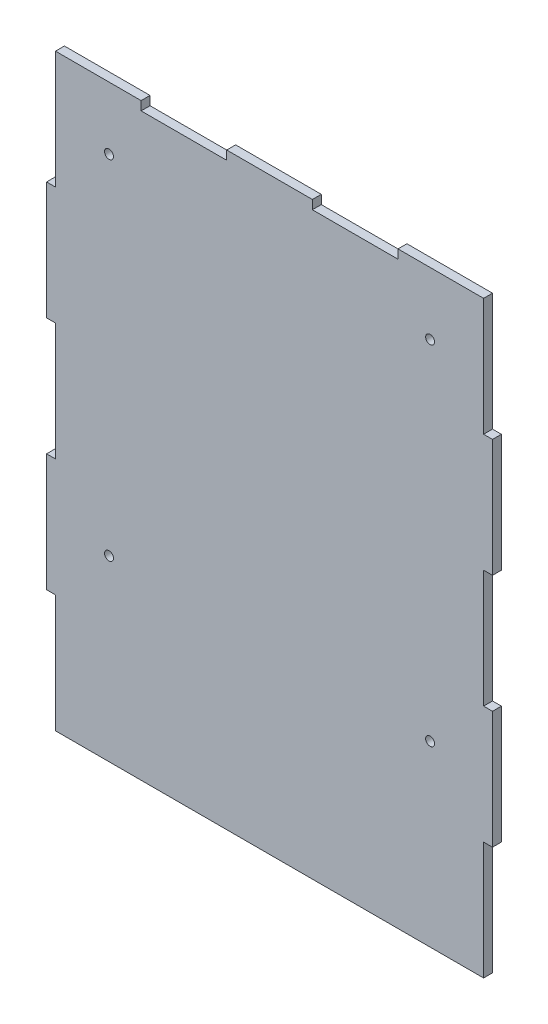
ISO-10303-21;
HEADER;
FILE_DESCRIPTION(('STEP AP214'),'2;1');
FILE_NAME('part.step','',(''),(''),'','','');
FILE_SCHEMA(('AUTOMOTIVE_DESIGN { 1 0 10303 214 1 1 1 1 }'));
ENDSEC;
DATA;
#1=APPLICATION_CONTEXT('core data for automotive mechanical design processes');
#2=APPLICATION_PROTOCOL_DEFINITION('international standard','automotive_design',2000,#1);
#3=PRODUCT_CONTEXT('',#1,'mechanical');
#4=PRODUCT('Part','Part','',(#3));
#5=PRODUCT_RELATED_PRODUCT_CATEGORY('part','',(#4));
#6=PRODUCT_DEFINITION_FORMATION('','',#4);
#7=PRODUCT_DEFINITION_CONTEXT('part definition',#1,'design');
#8=PRODUCT_DEFINITION('design','',#6,#7);
#9=PRODUCT_DEFINITION_SHAPE('','',#8);
#10=(LENGTH_UNIT() NAMED_UNIT(*) SI_UNIT(.MILLI.,.METRE.));
#11=(NAMED_UNIT(*) PLANE_ANGLE_UNIT() SI_UNIT($,.RADIAN.));
#12=(NAMED_UNIT(*) SI_UNIT($,.STERADIAN.) SOLID_ANGLE_UNIT());
#13=UNCERTAINTY_MEASURE_WITH_UNIT(LENGTH_MEASURE(1.E-05),#10,'distance_accuracy_value','');
#14=(GEOMETRIC_REPRESENTATION_CONTEXT(3) GLOBAL_UNCERTAINTY_ASSIGNED_CONTEXT((#13)) GLOBAL_UNIT_ASSIGNED_CONTEXT((#10,
#11,#12)) REPRESENTATION_CONTEXT('',''));
#15=CARTESIAN_POINT('',(0.,0.,0.));
#16=DIRECTION('',(0.,0.,1.));
#17=DIRECTION('',(1.,0.,0.));
#18=AXIS2_PLACEMENT_3D('',#15,#16,#17);
#19=CARTESIAN_POINT('',(250.,198.,5.));
#20=DIRECTION('',(-1.,0.,0.));
#21=DIRECTION('',(0.,0.,1.));
#22=AXIS2_PLACEMENT_3D('',#19,#20,#21);
#23=PLANE('',#22);
#24=DIRECTION('',(0.,1.,0.));
#25=VECTOR('',#24,1.);
#26=CARTESIAN_POINT('',(250.,198.,0.));
#27=LINE('',#26,#25);
#28=CARTESIAN_POINT('',(250.,198.,0.));
#29=VERTEX_POINT('',#28);
#30=CARTESIAN_POINT('',(250.,264.,0.));
#31=VERTEX_POINT('',#30);
#32=EDGE_CURVE('E261',#29,#31,#27,.T.);
#33=ORIENTED_EDGE('',*,*,#32,.T.);
#34=DIRECTION('',(0.,0.,-1.));
#35=VECTOR('',#34,1.);
#36=CARTESIAN_POINT('',(250.,264.,5.));
#37=LINE('',#36,#35);
#38=CARTESIAN_POINT('',(250.,264.,5.));
#39=VERTEX_POINT('',#38);
#40=EDGE_CURVE('E11',#39,#31,#37,.T.);
#41=ORIENTED_EDGE('',*,*,#40,.F.);
#42=DIRECTION('',(0.,1.,0.));
#43=VECTOR('',#42,1.);
#44=CARTESIAN_POINT('',(250.,198.,5.));
#45=LINE('',#44,#43);
#46=CARTESIAN_POINT('',(250.,198.,5.));
#47=VERTEX_POINT('',#46);
#48=EDGE_CURVE('E344',#47,#39,#45,.T.);
#49=ORIENTED_EDGE('',*,*,#48,.F.);
#50=DIRECTION('',(0.,0.,-1.));
#51=VECTOR('',#50,1.);
#52=CARTESIAN_POINT('',(250.,198.,5.));
#53=LINE('',#52,#51);
#54=EDGE_CURVE('E257',#47,#29,#53,.T.);
#55=ORIENTED_EDGE('',*,*,#54,.T.);
#56=EDGE_LOOP('',(#33,#41,#49,#55));
#57=FACE_BOUND('',#56,.T.);
#58=ADVANCED_FACE('F40',(#57),#23,.F.);
#59=CARTESIAN_POINT('',(250.,264.,5.));
#60=DIRECTION('',(0.,-1.,0.));
#61=DIRECTION('',(0.,0.,-1.));
#62=AXIS2_PLACEMENT_3D('',#59,#60,#61);
#63=PLANE('',#62);
#64=DIRECTION('',(-1.,0.,0.));
#65=VECTOR('',#64,1.);
#66=CARTESIAN_POINT('',(250.,264.,0.));
#67=LINE('',#66,#65);
#68=CARTESIAN_POINT('',(245.,264.,0.));
#69=VERTEX_POINT('',#68);
#70=EDGE_CURVE('E265',#31,#69,#67,.T.);
#71=ORIENTED_EDGE('',*,*,#70,.T.);
#72=DIRECTION('',(0.,0.,-1.));
#73=VECTOR('',#72,1.);
#74=CARTESIAN_POINT('',(245.,264.,5.));
#75=LINE('',#74,#73);
#76=CARTESIAN_POINT('',(245.,264.,5.));
#77=VERTEX_POINT('',#76);
#78=EDGE_CURVE('E49',#77,#69,#75,.T.);
#79=ORIENTED_EDGE('',*,*,#78,.F.);
#80=DIRECTION('',(-1.,0.,0.));
#81=VECTOR('',#80,1.);
#82=CARTESIAN_POINT('',(250.,264.,5.));
#83=LINE('',#82,#81);
#84=EDGE_CURVE('E160',#39,#77,#83,.T.);
#85=ORIENTED_EDGE('',*,*,#84,.F.);
#86=ORIENTED_EDGE('',*,*,#40,.T.);
#87=EDGE_LOOP('',(#71,#79,#85,#86));
#88=FACE_BOUND('',#87,.T.);
#89=ADVANCED_FACE('F552',(#88),#63,.F.);
#90=CARTESIAN_POINT('',(245.,264.,5.));
#91=DIRECTION('',(-1.,0.,0.));
#92=DIRECTION('',(0.,0.,1.));
#93=AXIS2_PLACEMENT_3D('',#90,#91,#92);
#94=PLANE('',#93);
#95=DIRECTION('',(0.,1.,0.));
#96=VECTOR('',#95,1.);
#97=CARTESIAN_POINT('',(245.,264.,0.));
#98=LINE('',#97,#96);
#99=CARTESIAN_POINT('',(245.,330.,0.));
#100=VERTEX_POINT('',#99);
#101=EDGE_CURVE('E269',#69,#100,#98,.T.);
#102=ORIENTED_EDGE('',*,*,#101,.T.);
#103=DIRECTION('',(0.,0.,-1.));
#104=VECTOR('',#103,1.);
#105=CARTESIAN_POINT('',(245.,330.,5.));
#106=LINE('',#105,#104);
#107=CARTESIAN_POINT('',(245.,330.,5.));
#108=VERTEX_POINT('',#107);
#109=EDGE_CURVE('E435',#108,#100,#106,.T.);
#110=ORIENTED_EDGE('',*,*,#109,.F.);
#111=DIRECTION('',(0.,1.,0.));
#112=VECTOR('',#111,1.);
#113=CARTESIAN_POINT('',(245.,264.,5.));
#114=LINE('',#113,#112);
#115=EDGE_CURVE('E445',#77,#108,#114,.T.);
#116=ORIENTED_EDGE('',*,*,#115,.F.);
#117=ORIENTED_EDGE('',*,*,#78,.T.);
#118=EDGE_LOOP('',(#102,#110,#116,#117));
#119=FACE_BOUND('',#118,.T.);
#120=ADVANCED_FACE('F443',(#119),#94,.F.);
#121=CARTESIAN_POINT('',(197.,330.,5.));
#122=DIRECTION('',(0.,-1.,0.));
#123=DIRECTION('',(0.,0.,-1.));
#124=AXIS2_PLACEMENT_3D('',#121,#122,#123);
#125=PLANE('',#124);
#126=DIRECTION('',(-1.,0.,0.));
#127=VECTOR('',#126,1.);
#128=CARTESIAN_POINT('',(197.,330.,0.));
#129=LINE('',#128,#127);
#130=CARTESIAN_POINT('',(197.,330.,0.));
#131=VERTEX_POINT('',#130);
#132=EDGE_CURVE('E272',#100,#131,#129,.T.);
#133=ORIENTED_EDGE('',*,*,#132,.T.);
#134=DIRECTION('',(0.,0.,-1.));
#135=VECTOR('',#134,1.);
#136=CARTESIAN_POINT('',(197.,330.,5.));
#137=LINE('',#136,#135);
#138=CARTESIAN_POINT('',(197.,330.,5.));
#139=VERTEX_POINT('',#138);
#140=EDGE_CURVE('E431',#139,#131,#137,.T.);
#141=ORIENTED_EDGE('',*,*,#140,.F.);
#142=DIRECTION('',(-1.,0.,0.));
#143=VECTOR('',#142,1.);
#144=CARTESIAN_POINT('',(197.,330.,5.));
#145=LINE('',#144,#143);
#146=EDGE_CURVE('E464',#108,#139,#145,.T.);
#147=ORIENTED_EDGE('',*,*,#146,.F.);
#148=ORIENTED_EDGE('',*,*,#109,.T.);
#149=EDGE_LOOP('',(#133,#141,#147,#148));
#150=FACE_BOUND('',#149,.T.);
#151=ADVANCED_FACE('F454',(#150),#125,.F.);
#152=CARTESIAN_POINT('',(197.,325.,5.));
#153=DIRECTION('',(1.,0.,0.));
#154=DIRECTION('',(0.,1.,0.));
#155=AXIS2_PLACEMENT_3D('',#152,#153,#154);
#156=PLANE('',#155);
#157=DIRECTION('',(0.,-1.,0.));
#158=VECTOR('',#157,1.);
#159=CARTESIAN_POINT('',(197.,325.,0.));
#160=LINE('',#159,#158);
#161=CARTESIAN_POINT('',(197.,325.,0.));
#162=VERTEX_POINT('',#161);
#163=EDGE_CURVE('E275',#131,#162,#160,.T.);
#164=ORIENTED_EDGE('',*,*,#163,.T.);
#165=DIRECTION('',(0.,0.,-1.));
#166=VECTOR('',#165,1.);
#167=CARTESIAN_POINT('',(197.,325.,5.));
#168=LINE('',#167,#166);
#169=CARTESIAN_POINT('',(197.,325.,5.));
#170=VERTEX_POINT('',#169);
#171=EDGE_CURVE('E427',#170,#162,#168,.T.);
#172=ORIENTED_EDGE('',*,*,#171,.F.);
#173=DIRECTION('',(0.,-1.,0.));
#174=VECTOR('',#173,1.);
#175=CARTESIAN_POINT('',(197.,325.,5.));
#176=LINE('',#175,#174);
#177=EDGE_CURVE('E460',#139,#170,#176,.T.);
#178=ORIENTED_EDGE('',*,*,#177,.F.);
#179=ORIENTED_EDGE('',*,*,#140,.T.);
#180=EDGE_LOOP('',(#164,#172,#178,#179));
#181=FACE_BOUND('',#180,.T.);
#182=ADVANCED_FACE('F458',(#181),#156,.F.);
#183=CARTESIAN_POINT('',(149.,325.,5.));
#184=DIRECTION('',(0.,-1.,0.));
#185=DIRECTION('',(0.,0.,-1.));
#186=AXIS2_PLACEMENT_3D('',#183,#184,#185);
#187=PLANE('',#186);
#188=DIRECTION('',(-1.,0.,0.));
#189=VECTOR('',#188,1.);
#190=CARTESIAN_POINT('',(149.,325.,0.));
#191=LINE('',#190,#189);
#192=CARTESIAN_POINT('',(149.,325.,0.));
#193=VERTEX_POINT('',#192);
#194=EDGE_CURVE('E278',#162,#193,#191,.T.);
#195=ORIENTED_EDGE('',*,*,#194,.T.);
#196=DIRECTION('',(0.,0.,-1.));
#197=VECTOR('',#196,1.);
#198=CARTESIAN_POINT('',(149.,325.,5.));
#199=LINE('',#198,#197);
#200=CARTESIAN_POINT('',(149.,325.,5.));
#201=VERTEX_POINT('',#200);
#202=EDGE_CURVE('E423',#201,#193,#199,.T.);
#203=ORIENTED_EDGE('',*,*,#202,.F.);
#204=DIRECTION('',(-1.,0.,0.));
#205=VECTOR('',#204,1.);
#206=CARTESIAN_POINT('',(149.,325.,5.));
#207=LINE('',#206,#205);
#208=EDGE_CURVE('E463',#170,#201,#207,.T.);
#209=ORIENTED_EDGE('',*,*,#208,.F.);
#210=ORIENTED_EDGE('',*,*,#171,.T.);
#211=EDGE_LOOP('',(#195,#203,#209,#210));
#212=FACE_BOUND('',#211,.T.);
#213=ADVANCED_FACE('F565',(#212),#187,.F.);
#214=CARTESIAN_POINT('',(149.,330.,5.));
#215=DIRECTION('',(-1.,0.,0.));
#216=DIRECTION('',(0.,-1.,0.));
#217=AXIS2_PLACEMENT_3D('',#214,#215,#216);
#218=PLANE('',#217);
#219=DIRECTION('',(0.,1.,0.));
#220=VECTOR('',#219,1.);
#221=CARTESIAN_POINT('',(149.,330.,0.));
#222=LINE('',#221,#220);
#223=CARTESIAN_POINT('',(149.,330.,0.));
#224=VERTEX_POINT('',#223);
#225=EDGE_CURVE('E281',#193,#224,#222,.T.);
#226=ORIENTED_EDGE('',*,*,#225,.T.);
#227=DIRECTION('',(0.,0.,-1.));
#228=VECTOR('',#227,1.);
#229=CARTESIAN_POINT('',(149.,330.,5.));
#230=LINE('',#229,#228);
#231=CARTESIAN_POINT('',(149.,330.,5.));
#232=VERTEX_POINT('',#231);
#233=EDGE_CURVE('E419',#232,#224,#230,.T.);
#234=ORIENTED_EDGE('',*,*,#233,.F.);
#235=DIRECTION('',(0.,1.,0.));
#236=VECTOR('',#235,1.);
#237=CARTESIAN_POINT('',(149.,330.,5.));
#238=LINE('',#237,#236);
#239=EDGE_CURVE('E468',#201,#232,#238,.T.);
#240=ORIENTED_EDGE('',*,*,#239,.F.);
#241=ORIENTED_EDGE('',*,*,#202,.T.);
#242=EDGE_LOOP('',(#226,#234,#240,#241));
#243=FACE_BOUND('',#242,.T.);
#244=ADVANCED_FACE('F568',(#243),#218,.F.);
#245=CARTESIAN_POINT('',(101.,330.,5.));
#246=DIRECTION('',(0.,-1.,0.));
#247=DIRECTION('',(0.,0.,-1.));
#248=AXIS2_PLACEMENT_3D('',#245,#246,#247);
#249=PLANE('',#248);
#250=DIRECTION('',(-1.,0.,0.));
#251=VECTOR('',#250,1.);
#252=CARTESIAN_POINT('',(101.,330.,0.));
#253=LINE('',#252,#251);
#254=CARTESIAN_POINT('',(101.,330.,0.));
#255=VERTEX_POINT('',#254);
#256=EDGE_CURVE('E284',#224,#255,#253,.T.);
#257=ORIENTED_EDGE('',*,*,#256,.T.);
#258=DIRECTION('',(0.,0.,-1.));
#259=VECTOR('',#258,1.);
#260=CARTESIAN_POINT('',(101.,330.,5.));
#261=LINE('',#260,#259);
#262=CARTESIAN_POINT('',(101.,330.,5.));
#263=VERTEX_POINT('',#262);
#264=EDGE_CURVE('E415',#263,#255,#261,.T.);
#265=ORIENTED_EDGE('',*,*,#264,.F.);
#266=DIRECTION('',(-1.,0.,0.));
#267=VECTOR('',#266,1.);
#268=CARTESIAN_POINT('',(101.,330.,5.));
#269=LINE('',#268,#267);
#270=EDGE_CURVE('E475',#232,#263,#269,.T.);
#271=ORIENTED_EDGE('',*,*,#270,.F.);
#272=ORIENTED_EDGE('',*,*,#233,.T.);
#273=EDGE_LOOP('',(#257,#265,#271,#272));
#274=FACE_BOUND('',#273,.T.);
#275=ADVANCED_FACE('F572',(#274),#249,.F.);
#276=CARTESIAN_POINT('',(101.,325.,5.));
#277=DIRECTION('',(1.,0.,0.));
#278=DIRECTION('',(0.,1.,0.));
#279=AXIS2_PLACEMENT_3D('',#276,#277,#278);
#280=PLANE('',#279);
#281=DIRECTION('',(0.,-1.,0.));
#282=VECTOR('',#281,1.);
#283=CARTESIAN_POINT('',(101.,325.,0.));
#284=LINE('',#283,#282);
#285=CARTESIAN_POINT('',(101.,325.,0.));
#286=VERTEX_POINT('',#285);
#287=EDGE_CURVE('E287',#255,#286,#284,.T.);
#288=ORIENTED_EDGE('',*,*,#287,.T.);
#289=DIRECTION('',(0.,0.,-1.));
#290=VECTOR('',#289,1.);
#291=CARTESIAN_POINT('',(101.,325.,5.));
#292=LINE('',#291,#290);
#293=CARTESIAN_POINT('',(101.,325.,5.));
#294=VERTEX_POINT('',#293);
#295=EDGE_CURVE('E411',#294,#286,#292,.T.);
#296=ORIENTED_EDGE('',*,*,#295,.F.);
#297=DIRECTION('',(0.,-1.,0.));
#298=VECTOR('',#297,1.);
#299=CARTESIAN_POINT('',(101.,325.,5.));
#300=LINE('',#299,#298);
#301=EDGE_CURVE('E478',#263,#294,#300,.T.);
#302=ORIENTED_EDGE('',*,*,#301,.F.);
#303=ORIENTED_EDGE('',*,*,#264,.T.);
#304=EDGE_LOOP('',(#288,#296,#302,#303));
#305=FACE_BOUND('',#304,.T.);
#306=ADVANCED_FACE('F576',(#305),#280,.F.);
#307=CARTESIAN_POINT('',(53.,325.,5.));
#308=DIRECTION('',(0.,-1.,0.));
#309=DIRECTION('',(0.,0.,-1.));
#310=AXIS2_PLACEMENT_3D('',#307,#308,#309);
#311=PLANE('',#310);
#312=DIRECTION('',(-1.,0.,0.));
#313=VECTOR('',#312,1.);
#314=CARTESIAN_POINT('',(53.,325.,0.));
#315=LINE('',#314,#313);
#316=CARTESIAN_POINT('',(53.,325.,0.));
#317=VERTEX_POINT('',#316);
#318=EDGE_CURVE('E290',#286,#317,#315,.T.);
#319=ORIENTED_EDGE('',*,*,#318,.T.);
#320=DIRECTION('',(0.,0.,-1.));
#321=VECTOR('',#320,1.);
#322=CARTESIAN_POINT('',(53.,325.,5.));
#323=LINE('',#322,#321);
#324=CARTESIAN_POINT('',(53.,325.,5.));
#325=VERTEX_POINT('',#324);
#326=EDGE_CURVE('E407',#325,#317,#323,.T.);
#327=ORIENTED_EDGE('',*,*,#326,.F.);
#328=DIRECTION('',(-1.,0.,0.));
#329=VECTOR('',#328,1.);
#330=CARTESIAN_POINT('',(53.,325.,5.));
#331=LINE('',#330,#329);
#332=EDGE_CURVE('E481',#294,#325,#331,.T.);
#333=ORIENTED_EDGE('',*,*,#332,.F.);
#334=ORIENTED_EDGE('',*,*,#295,.T.);
#335=EDGE_LOOP('',(#319,#327,#333,#334));
#336=FACE_BOUND('',#335,.T.);
#337=ADVANCED_FACE('F580',(#336),#311,.F.);
#338=CARTESIAN_POINT('',(52.9999999999999,330.,5.));
#339=DIRECTION('',(-1.,0.,0.));
#340=DIRECTION('',(0.,-1.,0.));
#341=AXIS2_PLACEMENT_3D('',#338,#339,#340);
#342=PLANE('',#341);
#343=DIRECTION('',(0.,1.,0.));
#344=VECTOR('',#343,1.);
#345=CARTESIAN_POINT('',(52.9999999999999,330.,0.));
#346=LINE('',#345,#344);
#347=CARTESIAN_POINT('',(52.9999999999999,330.,0.));
#348=VERTEX_POINT('',#347);
#349=EDGE_CURVE('E293',#317,#348,#346,.T.);
#350=ORIENTED_EDGE('',*,*,#349,.T.);
#351=DIRECTION('',(0.,0.,-1.));
#352=VECTOR('',#351,1.);
#353=CARTESIAN_POINT('',(52.9999999999999,330.,5.));
#354=LINE('',#353,#352);
#355=CARTESIAN_POINT('',(52.9999999999999,330.,5.));
#356=VERTEX_POINT('',#355);
#357=EDGE_CURVE('E403',#356,#348,#354,.T.);
#358=ORIENTED_EDGE('',*,*,#357,.F.);
#359=DIRECTION('',(0.,1.,0.));
#360=VECTOR('',#359,1.);
#361=CARTESIAN_POINT('',(52.9999999999999,330.,5.));
#362=LINE('',#361,#360);
#363=EDGE_CURVE('E484',#325,#356,#362,.T.);
#364=ORIENTED_EDGE('',*,*,#363,.F.);
#365=ORIENTED_EDGE('',*,*,#326,.T.);
#366=EDGE_LOOP('',(#350,#358,#364,#365));
#367=FACE_BOUND('',#366,.T.);
#368=ADVANCED_FACE('F584',(#367),#342,.F.);
#369=CARTESIAN_POINT('',(5.,330.,5.));
#370=DIRECTION('',(0.,-1.,0.));
#371=DIRECTION('',(0.,0.,-1.));
#372=AXIS2_PLACEMENT_3D('',#369,#370,#371);
#373=PLANE('',#372);
#374=DIRECTION('',(-1.,0.,0.));
#375=VECTOR('',#374,1.);
#376=CARTESIAN_POINT('',(5.,330.,0.));
#377=LINE('',#376,#375);
#378=CARTESIAN_POINT('',(5.,330.,0.));
#379=VERTEX_POINT('',#378);
#380=EDGE_CURVE('E296',#348,#379,#377,.T.);
#381=ORIENTED_EDGE('',*,*,#380,.T.);
#382=DIRECTION('',(0.,0.,-1.));
#383=VECTOR('',#382,1.);
#384=CARTESIAN_POINT('',(5.,330.,5.));
#385=LINE('',#384,#383);
#386=CARTESIAN_POINT('',(5.,330.,5.));
#387=VERTEX_POINT('',#386);
#388=EDGE_CURVE('E399',#387,#379,#385,.T.);
#389=ORIENTED_EDGE('',*,*,#388,.F.);
#390=DIRECTION('',(-1.,0.,0.));
#391=VECTOR('',#390,1.);
#392=CARTESIAN_POINT('',(5.,330.,5.));
#393=LINE('',#392,#391);
#394=EDGE_CURVE('E487',#356,#387,#393,.T.);
#395=ORIENTED_EDGE('',*,*,#394,.F.);
#396=ORIENTED_EDGE('',*,*,#357,.T.);
#397=EDGE_LOOP('',(#381,#389,#395,#396));
#398=FACE_BOUND('',#397,.T.);
#399=ADVANCED_FACE('F588',(#398),#373,.F.);
#400=CARTESIAN_POINT('',(5.,330.,5.));
#401=DIRECTION('',(1.,0.,0.));
#402=DIRECTION('',(0.,1.,0.));
#403=AXIS2_PLACEMENT_3D('',#400,#401,#402);
#404=PLANE('',#403);
#405=DIRECTION('',(0.,-1.,0.));
#406=VECTOR('',#405,1.);
#407=CARTESIAN_POINT('',(5.,330.,0.));
#408=LINE('',#407,#406);
#409=CARTESIAN_POINT('',(5.00000000000001,264.,0.));
#410=VERTEX_POINT('',#409);
#411=EDGE_CURVE('E299',#379,#410,#408,.T.);
#412=ORIENTED_EDGE('',*,*,#411,.T.);
#413=DIRECTION('',(0.,0.,-1.));
#414=VECTOR('',#413,1.);
#415=CARTESIAN_POINT('',(5.00000000000001,264.,5.));
#416=LINE('',#415,#414);
#417=CARTESIAN_POINT('',(5.00000000000001,264.,5.));
#418=VERTEX_POINT('',#417);
#419=EDGE_CURVE('E395',#418,#410,#416,.T.);
#420=ORIENTED_EDGE('',*,*,#419,.F.);
#421=DIRECTION('',(0.,-1.,0.));
#422=VECTOR('',#421,1.);
#423=CARTESIAN_POINT('',(5.,330.,5.));
#424=LINE('',#423,#422);
#425=EDGE_CURVE('E490',#387,#418,#424,.T.);
#426=ORIENTED_EDGE('',*,*,#425,.F.);
#427=ORIENTED_EDGE('',*,*,#388,.T.);
#428=EDGE_LOOP('',(#412,#420,#426,#427));
#429=FACE_BOUND('',#428,.T.);
#430=ADVANCED_FACE('F592',(#429),#404,.F.);
#431=CARTESIAN_POINT('',(5.00000000000001,264.,5.));
#432=DIRECTION('',(0.,-1.,0.));
#433=DIRECTION('',(0.,0.,-1.));
#434=AXIS2_PLACEMENT_3D('',#431,#432,#433);
#435=PLANE('',#434);
#436=DIRECTION('',(-1.,0.,0.));
#437=VECTOR('',#436,1.);
#438=CARTESIAN_POINT('',(5.00000000000001,264.,0.));
#439=LINE('',#438,#437);
#440=CARTESIAN_POINT('',(0.,264.,0.));
#441=VERTEX_POINT('',#440);
#442=EDGE_CURVE('E302',#410,#441,#439,.T.);
#443=ORIENTED_EDGE('',*,*,#442,.T.);
#444=DIRECTION('',(0.,0.,-1.));
#445=VECTOR('',#444,1.);
#446=CARTESIAN_POINT('',(0.,264.,5.));
#447=LINE('',#446,#445);
#448=CARTESIAN_POINT('',(0.,264.,5.));
#449=VERTEX_POINT('',#448);
#450=EDGE_CURVE('E391',#449,#441,#447,.T.);
#451=ORIENTED_EDGE('',*,*,#450,.F.);
#452=DIRECTION('',(-1.,0.,0.));
#453=VECTOR('',#452,1.);
#454=CARTESIAN_POINT('',(5.00000000000001,264.,5.));
#455=LINE('',#454,#453);
#456=EDGE_CURVE('E493',#418,#449,#455,.T.);
#457=ORIENTED_EDGE('',*,*,#456,.F.);
#458=ORIENTED_EDGE('',*,*,#419,.T.);
#459=EDGE_LOOP('',(#443,#451,#457,#458));
#460=FACE_BOUND('',#459,.T.);
#461=ADVANCED_FACE('F596',(#460),#435,.F.);
#462=CARTESIAN_POINT('',(0.,198.,5.));
#463=DIRECTION('',(1.,0.,0.));
#464=DIRECTION('',(0.,0.,-1.));
#465=AXIS2_PLACEMENT_3D('',#462,#463,#464);
#466=PLANE('',#465);
#467=DIRECTION('',(0.,-1.,0.));
#468=VECTOR('',#467,1.);
#469=CARTESIAN_POINT('',(0.,198.,0.));
#470=LINE('',#469,#468);
#471=CARTESIAN_POINT('',(0.,198.,0.));
#472=VERTEX_POINT('',#471);
#473=EDGE_CURVE('E305',#441,#472,#470,.T.);
#474=ORIENTED_EDGE('',*,*,#473,.T.);
#475=DIRECTION('',(0.,0.,-1.));
#476=VECTOR('',#475,1.);
#477=CARTESIAN_POINT('',(0.,198.,5.));
#478=LINE('',#477,#476);
#479=CARTESIAN_POINT('',(0.,198.,5.));
#480=VERTEX_POINT('',#479);
#481=EDGE_CURVE('E387',#480,#472,#478,.T.);
#482=ORIENTED_EDGE('',*,*,#481,.F.);
#483=DIRECTION('',(0.,-1.,0.));
#484=VECTOR('',#483,1.);
#485=CARTESIAN_POINT('',(0.,198.,5.));
#486=LINE('',#485,#484);
#487=EDGE_CURVE('E496',#449,#480,#486,.T.);
#488=ORIENTED_EDGE('',*,*,#487,.F.);
#489=ORIENTED_EDGE('',*,*,#450,.T.);
#490=EDGE_LOOP('',(#474,#482,#488,#489));
#491=FACE_BOUND('',#490,.T.);
#492=ADVANCED_FACE('F600',(#491),#466,.F.);
#493=CARTESIAN_POINT('',(5.,198.,5.));
#494=DIRECTION('',(0.,1.,0.));
#495=DIRECTION('',(0.,0.,1.));
#496=AXIS2_PLACEMENT_3D('',#493,#494,#495);
#497=PLANE('',#496);
#498=DIRECTION('',(1.,0.,0.));
#499=VECTOR('',#498,1.);
#500=CARTESIAN_POINT('',(5.,198.,0.));
#501=LINE('',#500,#499);
#502=CARTESIAN_POINT('',(5.,198.,0.));
#503=VERTEX_POINT('',#502);
#504=EDGE_CURVE('E308',#472,#503,#501,.T.);
#505=ORIENTED_EDGE('',*,*,#504,.T.);
#506=DIRECTION('',(0.,0.,-1.));
#507=VECTOR('',#506,1.);
#508=CARTESIAN_POINT('',(5.,198.,5.));
#509=LINE('',#508,#507);
#510=CARTESIAN_POINT('',(5.,198.,5.));
#511=VERTEX_POINT('',#510);
#512=EDGE_CURVE('E383',#511,#503,#509,.T.);
#513=ORIENTED_EDGE('',*,*,#512,.F.);
#514=DIRECTION('',(1.,0.,0.));
#515=VECTOR('',#514,1.);
#516=CARTESIAN_POINT('',(5.,198.,5.));
#517=LINE('',#516,#515);
#518=EDGE_CURVE('E499',#480,#511,#517,.T.);
#519=ORIENTED_EDGE('',*,*,#518,.F.);
#520=ORIENTED_EDGE('',*,*,#481,.T.);
#521=EDGE_LOOP('',(#505,#513,#519,#520));
#522=FACE_BOUND('',#521,.T.);
#523=ADVANCED_FACE('F604',(#522),#497,.F.);
#524=CARTESIAN_POINT('',(5.,132.,5.));
#525=DIRECTION('',(1.,0.,0.));
#526=DIRECTION('',(0.,1.,0.));
#527=AXIS2_PLACEMENT_3D('',#524,#525,#526);
#528=PLANE('',#527);
#529=DIRECTION('',(0.,-1.,0.));
#530=VECTOR('',#529,1.);
#531=CARTESIAN_POINT('',(5.,132.,0.));
#532=LINE('',#531,#530);
#533=CARTESIAN_POINT('',(5.,132.,0.));
#534=VERTEX_POINT('',#533);
#535=EDGE_CURVE('E311',#503,#534,#532,.T.);
#536=ORIENTED_EDGE('',*,*,#535,.T.);
#537=DIRECTION('',(0.,0.,-1.));
#538=VECTOR('',#537,1.);
#539=CARTESIAN_POINT('',(5.,132.,5.));
#540=LINE('',#539,#538);
#541=CARTESIAN_POINT('',(5.,132.,5.));
#542=VERTEX_POINT('',#541);
#543=EDGE_CURVE('E379',#542,#534,#540,.T.);
#544=ORIENTED_EDGE('',*,*,#543,.F.);
#545=DIRECTION('',(0.,-1.,0.));
#546=VECTOR('',#545,1.);
#547=CARTESIAN_POINT('',(5.,132.,5.));
#548=LINE('',#547,#546);
#549=EDGE_CURVE('E502',#511,#542,#548,.T.);
#550=ORIENTED_EDGE('',*,*,#549,.F.);
#551=ORIENTED_EDGE('',*,*,#512,.T.);
#552=EDGE_LOOP('',(#536,#544,#550,#551));
#553=FACE_BOUND('',#552,.T.);
#554=ADVANCED_FACE('F608',(#553),#528,.F.);
#555=CARTESIAN_POINT('',(0.,132.,5.));
#556=DIRECTION('',(0.,-1.,0.));
#557=DIRECTION('',(0.,0.,-1.));
#558=AXIS2_PLACEMENT_3D('',#555,#556,#557);
#559=PLANE('',#558);
#560=DIRECTION('',(-1.,0.,0.));
#561=VECTOR('',#560,1.);
#562=CARTESIAN_POINT('',(0.,132.,0.));
#563=LINE('',#562,#561);
#564=CARTESIAN_POINT('',(0.,132.,0.));
#565=VERTEX_POINT('',#564);
#566=EDGE_CURVE('E314',#534,#565,#563,.T.);
#567=ORIENTED_EDGE('',*,*,#566,.T.);
#568=DIRECTION('',(0.,0.,-1.));
#569=VECTOR('',#568,1.);
#570=CARTESIAN_POINT('',(0.,132.,5.));
#571=LINE('',#570,#569);
#572=CARTESIAN_POINT('',(0.,132.,5.));
#573=VERTEX_POINT('',#572);
#574=EDGE_CURVE('E375',#573,#565,#571,.T.);
#575=ORIENTED_EDGE('',*,*,#574,.F.);
#576=DIRECTION('',(-1.,0.,0.));
#577=VECTOR('',#576,1.);
#578=CARTESIAN_POINT('',(0.,132.,5.));
#579=LINE('',#578,#577);
#580=EDGE_CURVE('E505',#542,#573,#579,.T.);
#581=ORIENTED_EDGE('',*,*,#580,.F.);
#582=ORIENTED_EDGE('',*,*,#543,.T.);
#583=EDGE_LOOP('',(#567,#575,#581,#582));
#584=FACE_BOUND('',#583,.T.);
#585=ADVANCED_FACE('F612',(#584),#559,.F.);
#586=CARTESIAN_POINT('',(0.,66.,5.));
#587=DIRECTION('',(1.,0.,0.));
#588=DIRECTION('',(0.,0.,-1.));
#589=AXIS2_PLACEMENT_3D('',#586,#587,#588);
#590=PLANE('',#589);
#591=DIRECTION('',(0.,-1.,0.));
#592=VECTOR('',#591,1.);
#593=CARTESIAN_POINT('',(0.,66.,0.));
#594=LINE('',#593,#592);
#595=CARTESIAN_POINT('',(0.,66.,0.));
#596=VERTEX_POINT('',#595);
#597=EDGE_CURVE('E317',#565,#596,#594,.T.);
#598=ORIENTED_EDGE('',*,*,#597,.T.);
#599=DIRECTION('',(0.,0.,-1.));
#600=VECTOR('',#599,1.);
#601=CARTESIAN_POINT('',(0.,66.,5.));
#602=LINE('',#601,#600);
#603=CARTESIAN_POINT('',(0.,66.,5.));
#604=VERTEX_POINT('',#603);
#605=EDGE_CURVE('E371',#604,#596,#602,.T.);
#606=ORIENTED_EDGE('',*,*,#605,.F.);
#607=DIRECTION('',(0.,-1.,0.));
#608=VECTOR('',#607,1.);
#609=CARTESIAN_POINT('',(0.,66.,5.));
#610=LINE('',#609,#608);
#611=EDGE_CURVE('E508',#573,#604,#610,.T.);
#612=ORIENTED_EDGE('',*,*,#611,.F.);
#613=ORIENTED_EDGE('',*,*,#574,.T.);
#614=EDGE_LOOP('',(#598,#606,#612,#613));
#615=FACE_BOUND('',#614,.T.);
#616=ADVANCED_FACE('F616',(#615),#590,.F.);
#617=CARTESIAN_POINT('',(0.,66.,5.));
#618=DIRECTION('',(0.,1.,0.));
#619=DIRECTION('',(0.,0.,1.));
#620=AXIS2_PLACEMENT_3D('',#617,#618,#619);
#621=PLANE('',#620);
#622=DIRECTION('',(1.,0.,0.));
#623=VECTOR('',#622,1.);
#624=CARTESIAN_POINT('',(0.,66.,0.));
#625=LINE('',#624,#623);
#626=CARTESIAN_POINT('',(5.,66.,0.));
#627=VERTEX_POINT('',#626);
#628=EDGE_CURVE('E320',#596,#627,#625,.T.);
#629=ORIENTED_EDGE('',*,*,#628,.T.);
#630=DIRECTION('',(0.,0.,-1.));
#631=VECTOR('',#630,1.);
#632=CARTESIAN_POINT('',(5.,66.,5.));
#633=LINE('',#632,#631);
#634=CARTESIAN_POINT('',(5.,66.,5.));
#635=VERTEX_POINT('',#634);
#636=EDGE_CURVE('E367',#635,#627,#633,.T.);
#637=ORIENTED_EDGE('',*,*,#636,.F.);
#638=DIRECTION('',(1.,0.,0.));
#639=VECTOR('',#638,1.);
#640=CARTESIAN_POINT('',(0.,66.,5.));
#641=LINE('',#640,#639);
#642=EDGE_CURVE('E511',#604,#635,#641,.T.);
#643=ORIENTED_EDGE('',*,*,#642,.F.);
#644=ORIENTED_EDGE('',*,*,#605,.T.);
#645=EDGE_LOOP('',(#629,#637,#643,#644));
#646=FACE_BOUND('',#645,.T.);
#647=ADVANCED_FACE('F620',(#646),#621,.F.);
#648=CARTESIAN_POINT('',(5.,66.,5.));
#649=DIRECTION('',(1.,0.,0.));
#650=DIRECTION('',(0.,0.,-1.));
#651=AXIS2_PLACEMENT_3D('',#648,#649,#650);
#652=PLANE('',#651);
#653=DIRECTION('',(0.,-1.,0.));
#654=VECTOR('',#653,1.);
#655=CARTESIAN_POINT('',(5.,66.,0.));
#656=LINE('',#655,#654);
#657=CARTESIAN_POINT('',(5.,0.,0.));
#658=VERTEX_POINT('',#657);
#659=EDGE_CURVE('E323',#627,#658,#656,.T.);
#660=ORIENTED_EDGE('',*,*,#659,.T.);
#661=DIRECTION('',(0.,0.,-1.));
#662=VECTOR('',#661,1.);
#663=CARTESIAN_POINT('',(5.,0.,5.));
#664=LINE('',#663,#662);
#665=CARTESIAN_POINT('',(5.,0.,5.));
#666=VERTEX_POINT('',#665);
#667=EDGE_CURVE('E363',#666,#658,#664,.T.);
#668=ORIENTED_EDGE('',*,*,#667,.F.);
#669=DIRECTION('',(0.,-1.,0.));
#670=VECTOR('',#669,1.);
#671=CARTESIAN_POINT('',(5.,66.,5.));
#672=LINE('',#671,#670);
#673=EDGE_CURVE('E514',#635,#666,#672,.T.);
#674=ORIENTED_EDGE('',*,*,#673,.F.);
#675=ORIENTED_EDGE('',*,*,#636,.T.);
#676=EDGE_LOOP('',(#660,#668,#674,#675));
#677=FACE_BOUND('',#676,.T.);
#678=ADVANCED_FACE('F624',(#677),#652,.F.);
#679=CARTESIAN_POINT('',(5.,0.,5.));
#680=DIRECTION('',(0.,1.,0.));
#681=DIRECTION('',(0.,0.,1.));
#682=AXIS2_PLACEMENT_3D('',#679,#680,#681);
#683=PLANE('',#682);
#684=DIRECTION('',(1.,0.,0.));
#685=VECTOR('',#684,1.);
#686=CARTESIAN_POINT('',(5.,0.,0.));
#687=LINE('',#686,#685);
#688=CARTESIAN_POINT('',(245.,0.,0.));
#689=VERTEX_POINT('',#688);
#690=EDGE_CURVE('E326',#658,#689,#687,.T.);
#691=ORIENTED_EDGE('',*,*,#690,.T.);
#692=DIRECTION('',(0.,0.,-1.));
#693=VECTOR('',#692,1.);
#694=CARTESIAN_POINT('',(245.,0.,5.));
#695=LINE('',#694,#693);
#696=CARTESIAN_POINT('',(245.,0.,5.));
#697=VERTEX_POINT('',#696);
#698=EDGE_CURVE('E359',#697,#689,#695,.T.);
#699=ORIENTED_EDGE('',*,*,#698,.F.);
#700=DIRECTION('',(1.,0.,0.));
#701=VECTOR('',#700,1.);
#702=CARTESIAN_POINT('',(5.,0.,5.));
#703=LINE('',#702,#701);
#704=EDGE_CURVE('E517',#666,#697,#703,.T.);
#705=ORIENTED_EDGE('',*,*,#704,.F.);
#706=ORIENTED_EDGE('',*,*,#667,.T.);
#707=EDGE_LOOP('',(#691,#699,#705,#706));
#708=FACE_BOUND('',#707,.T.);
#709=ADVANCED_FACE('F628',(#708),#683,.F.);
#710=CARTESIAN_POINT('',(245.,66.,5.));
#711=DIRECTION('',(-1.,0.,0.));
#712=DIRECTION('',(0.,0.,1.));
#713=AXIS2_PLACEMENT_3D('',#710,#711,#712);
#714=PLANE('',#713);
#715=DIRECTION('',(0.,1.,0.));
#716=VECTOR('',#715,1.);
#717=CARTESIAN_POINT('',(245.,66.,0.));
#718=LINE('',#717,#716);
#719=CARTESIAN_POINT('',(245.,66.,0.));
#720=VERTEX_POINT('',#719);
#721=EDGE_CURVE('E329',#689,#720,#718,.T.);
#722=ORIENTED_EDGE('',*,*,#721,.T.);
#723=DIRECTION('',(0.,0.,-1.));
#724=VECTOR('',#723,1.);
#725=CARTESIAN_POINT('',(245.,66.,5.));
#726=LINE('',#725,#724);
#727=CARTESIAN_POINT('',(245.,66.,5.));
#728=VERTEX_POINT('',#727);
#729=EDGE_CURVE('E355',#728,#720,#726,.T.);
#730=ORIENTED_EDGE('',*,*,#729,.F.);
#731=DIRECTION('',(0.,1.,0.));
#732=VECTOR('',#731,1.);
#733=CARTESIAN_POINT('',(245.,66.,5.));
#734=LINE('',#733,#732);
#735=EDGE_CURVE('E520',#697,#728,#734,.T.);
#736=ORIENTED_EDGE('',*,*,#735,.F.);
#737=ORIENTED_EDGE('',*,*,#698,.T.);
#738=EDGE_LOOP('',(#722,#730,#736,#737));
#739=FACE_BOUND('',#738,.T.);
#740=ADVANCED_FACE('F632',(#739),#714,.F.);
#741=CARTESIAN_POINT('',(250.,66.,5.));
#742=DIRECTION('',(0.,1.,0.));
#743=DIRECTION('',(0.,0.,1.));
#744=AXIS2_PLACEMENT_3D('',#741,#742,#743);
#745=PLANE('',#744);
#746=DIRECTION('',(1.,0.,0.));
#747=VECTOR('',#746,1.);
#748=CARTESIAN_POINT('',(250.,66.,0.));
#749=LINE('',#748,#747);
#750=CARTESIAN_POINT('',(250.,66.,0.));
#751=VERTEX_POINT('',#750);
#752=EDGE_CURVE('E332',#720,#751,#749,.T.);
#753=ORIENTED_EDGE('',*,*,#752,.T.);
#754=DIRECTION('',(0.,0.,-1.));
#755=VECTOR('',#754,1.);
#756=CARTESIAN_POINT('',(250.,66.,5.));
#757=LINE('',#756,#755);
#758=CARTESIAN_POINT('',(250.,66.,5.));
#759=VERTEX_POINT('',#758);
#760=EDGE_CURVE('E351',#759,#751,#757,.T.);
#761=ORIENTED_EDGE('',*,*,#760,.F.);
#762=DIRECTION('',(1.,0.,0.));
#763=VECTOR('',#762,1.);
#764=CARTESIAN_POINT('',(250.,66.,5.));
#765=LINE('',#764,#763);
#766=EDGE_CURVE('E523',#728,#759,#765,.T.);
#767=ORIENTED_EDGE('',*,*,#766,.F.);
#768=ORIENTED_EDGE('',*,*,#729,.T.);
#769=EDGE_LOOP('',(#753,#761,#767,#768));
#770=FACE_BOUND('',#769,.T.);
#771=ADVANCED_FACE('F531',(#770),#745,.F.);
#772=CARTESIAN_POINT('',(250.,66.,5.));
#773=DIRECTION('',(-1.,0.,0.));
#774=DIRECTION('',(0.,0.,1.));
#775=AXIS2_PLACEMENT_3D('',#772,#773,#774);
#776=PLANE('',#775);
#777=DIRECTION('',(0.,1.,0.));
#778=VECTOR('',#777,1.);
#779=CARTESIAN_POINT('',(250.,66.,0.));
#780=LINE('',#779,#778);
#781=CARTESIAN_POINT('',(250.,132.,0.));
#782=VERTEX_POINT('',#781);
#783=EDGE_CURVE('E335',#751,#782,#780,.T.);
#784=ORIENTED_EDGE('',*,*,#783,.T.);
#785=DIRECTION('',(0.,0.,-1.));
#786=VECTOR('',#785,1.);
#787=CARTESIAN_POINT('',(250.,132.,5.));
#788=LINE('',#787,#786);
#789=CARTESIAN_POINT('',(250.,132.,5.));
#790=VERTEX_POINT('',#789);
#791=EDGE_CURVE('E250',#790,#782,#788,.T.);
#792=ORIENTED_EDGE('',*,*,#791,.F.);
#793=DIRECTION('',(0.,1.,0.));
#794=VECTOR('',#793,1.);
#795=CARTESIAN_POINT('',(250.,66.,5.));
#796=LINE('',#795,#794);
#797=EDGE_CURVE('E239',#759,#790,#796,.T.);
#798=ORIENTED_EDGE('',*,*,#797,.F.);
#799=ORIENTED_EDGE('',*,*,#760,.T.);
#800=EDGE_LOOP('',(#784,#792,#798,#799));
#801=FACE_BOUND('',#800,.T.);
#802=ADVANCED_FACE('F535',(#801),#776,.F.);
#803=CARTESIAN_POINT('',(245.,132.,5.));
#804=DIRECTION('',(0.,-1.,0.));
#805=DIRECTION('',(0.,0.,-1.));
#806=AXIS2_PLACEMENT_3D('',#803,#804,#805);
#807=PLANE('',#806);
#808=DIRECTION('',(-1.,0.,0.));
#809=VECTOR('',#808,1.);
#810=CARTESIAN_POINT('',(245.,132.,0.));
#811=LINE('',#810,#809);
#812=CARTESIAN_POINT('',(245.,132.,0.));
#813=VERTEX_POINT('',#812);
#814=EDGE_CURVE('E248',#782,#813,#811,.T.);
#815=ORIENTED_EDGE('',*,*,#814,.T.);
#816=DIRECTION('',(0.,0.,-1.));
#817=VECTOR('',#816,1.);
#818=CARTESIAN_POINT('',(245.,132.,5.));
#819=LINE('',#818,#817);
#820=CARTESIAN_POINT('',(245.,132.,5.));
#821=VERTEX_POINT('',#820);
#822=EDGE_CURVE('E245',#821,#813,#819,.T.);
#823=ORIENTED_EDGE('',*,*,#822,.F.);
#824=DIRECTION('',(-1.,0.,0.));
#825=VECTOR('',#824,1.);
#826=CARTESIAN_POINT('',(245.,132.,5.));
#827=LINE('',#826,#825);
#828=EDGE_CURVE('E233',#790,#821,#827,.T.);
#829=ORIENTED_EDGE('',*,*,#828,.F.);
#830=ORIENTED_EDGE('',*,*,#791,.T.);
#831=EDGE_LOOP('',(#815,#823,#829,#830));
#832=FACE_BOUND('',#831,.T.);
#833=ADVANCED_FACE('F246',(#832),#807,.F.);
#834=CARTESIAN_POINT('',(245.,198.,5.));
#835=DIRECTION('',(-1.,0.,0.));
#836=DIRECTION('',(0.,0.,1.));
#837=AXIS2_PLACEMENT_3D('',#834,#835,#836);
#838=PLANE('',#837);
#839=DIRECTION('',(0.,1.,0.));
#840=VECTOR('',#839,1.);
#841=CARTESIAN_POINT('',(245.,198.,0.));
#842=LINE('',#841,#840);
#843=CARTESIAN_POINT('',(245.,198.,0.));
#844=VERTEX_POINT('',#843);
#845=EDGE_CURVE('E146',#813,#844,#842,.T.);
#846=ORIENTED_EDGE('',*,*,#845,.T.);
#847=DIRECTION('',(0.,0.,-1.));
#848=VECTOR('',#847,1.);
#849=CARTESIAN_POINT('',(245.,198.,5.));
#850=LINE('',#849,#848);
#851=CARTESIAN_POINT('',(245.,198.,5.));
#852=VERTEX_POINT('',#851);
#853=EDGE_CURVE('E251',#852,#844,#850,.T.);
#854=ORIENTED_EDGE('',*,*,#853,.F.);
#855=DIRECTION('',(0.,1.,0.));
#856=VECTOR('',#855,1.);
#857=CARTESIAN_POINT('',(245.,198.,5.));
#858=LINE('',#857,#856);
#859=EDGE_CURVE('E237',#821,#852,#858,.T.);
#860=ORIENTED_EDGE('',*,*,#859,.F.);
#861=ORIENTED_EDGE('',*,*,#822,.T.);
#862=EDGE_LOOP('',(#846,#854,#860,#861));
#863=FACE_BOUND('',#862,.T.);
#864=ADVANCED_FACE('F253',(#863),#838,.F.);
#865=CARTESIAN_POINT('',(250.,198.,5.));
#866=DIRECTION('',(0.,1.,0.));
#867=DIRECTION('',(0.,0.,1.));
#868=AXIS2_PLACEMENT_3D('',#865,#866,#867);
#869=PLANE('',#868);
#870=DIRECTION('',(1.,0.,0.));
#871=VECTOR('',#870,1.);
#872=CARTESIAN_POINT('',(250.,198.,0.));
#873=LINE('',#872,#871);
#874=EDGE_CURVE('E152',#844,#29,#873,.T.);
#875=ORIENTED_EDGE('',*,*,#874,.T.);
#876=ORIENTED_EDGE('',*,*,#54,.F.);
#877=DIRECTION('',(1.,0.,0.));
#878=VECTOR('',#877,1.);
#879=CARTESIAN_POINT('',(250.,198.,5.));
#880=LINE('',#879,#878);
#881=EDGE_CURVE('E57',#852,#47,#880,.T.);
#882=ORIENTED_EDGE('',*,*,#881,.F.);
#883=ORIENTED_EDGE('',*,*,#853,.T.);
#884=EDGE_LOOP('',(#875,#876,#882,#883));
#885=FACE_BOUND('',#884,.T.);
#886=ADVANCED_FACE('F539',(#885),#869,.F.);
#887=CARTESIAN_POINT('',(0.,0.,5.));
#888=DIRECTION('',(0.,0.,1.));
#889=DIRECTION('',(1.,0.,0.));
#890=AXIS2_PLACEMENT_3D('',#887,#888,#889);
#891=PLANE('',#890);
#892=CARTESIAN_POINT('',(35.,295.,5.));
#893=DIRECTION('',(0.,0.,1.));
#894=DIRECTION('',(1.,0.,0.));
#895=AXIS2_PLACEMENT_3D('',#892,#893,#894);
#896=CIRCLE('',#895,2.5);
#897=CARTESIAN_POINT('',(37.5,295.,5.));
#898=VERTEX_POINT('',#897);
#899=EDGE_CURVE('E713',#898,#898,#896,.T.);
#900=ORIENTED_EDGE('',*,*,#899,.F.);
#901=EDGE_LOOP('',(#900));
#902=FACE_BOUND('',#901,.T.);
#903=CARTESIAN_POINT('',(215.,295.,5.));
#904=DIRECTION('',(0.,0.,1.));
#905=DIRECTION('',(1.,0.,0.));
#906=AXIS2_PLACEMENT_3D('',#903,#904,#905);
#907=CIRCLE('',#906,2.5);
#908=CARTESIAN_POINT('',(217.5,295.,5.));
#909=VERTEX_POINT('',#908);
#910=EDGE_CURVE('E717',#909,#909,#907,.T.);
#911=ORIENTED_EDGE('',*,*,#910,.F.);
#912=EDGE_LOOP('',(#911));
#913=FACE_BOUND('',#912,.T.);
#914=CARTESIAN_POINT('',(215.,100.,5.));
#915=DIRECTION('',(0.,0.,1.));
#916=DIRECTION('',(1.,0.,0.));
#917=AXIS2_PLACEMENT_3D('',#914,#915,#916);
#918=CIRCLE('',#917,2.5);
#919=CARTESIAN_POINT('',(217.5,100.,5.));
#920=VERTEX_POINT('',#919);
#921=EDGE_CURVE('E727',#920,#920,#918,.T.);
#922=ORIENTED_EDGE('',*,*,#921,.F.);
#923=EDGE_LOOP('',(#922));
#924=FACE_BOUND('',#923,.T.);
#925=CARTESIAN_POINT('',(35.,100.,5.));
#926=DIRECTION('',(0.,0.,1.));
#927=DIRECTION('',(1.,0.,0.));
#928=AXIS2_PLACEMENT_3D('',#925,#926,#927);
#929=CIRCLE('',#928,2.5);
#930=CARTESIAN_POINT('',(37.5,100.,5.));
#931=VERTEX_POINT('',#930);
#932=EDGE_CURVE('E735',#931,#931,#929,.T.);
#933=ORIENTED_EDGE('',*,*,#932,.F.);
#934=EDGE_LOOP('',(#933));
#935=FACE_BOUND('',#934,.T.);
#936=ORIENTED_EDGE('',*,*,#48,.T.);
#937=ORIENTED_EDGE('',*,*,#84,.T.);
#938=ORIENTED_EDGE('',*,*,#115,.T.);
#939=ORIENTED_EDGE('',*,*,#146,.T.);
#940=ORIENTED_EDGE('',*,*,#177,.T.);
#941=ORIENTED_EDGE('',*,*,#208,.T.);
#942=ORIENTED_EDGE('',*,*,#239,.T.);
#943=ORIENTED_EDGE('',*,*,#270,.T.);
#944=ORIENTED_EDGE('',*,*,#301,.T.);
#945=ORIENTED_EDGE('',*,*,#332,.T.);
#946=ORIENTED_EDGE('',*,*,#363,.T.);
#947=ORIENTED_EDGE('',*,*,#394,.T.);
#948=ORIENTED_EDGE('',*,*,#425,.T.);
#949=ORIENTED_EDGE('',*,*,#456,.T.);
#950=ORIENTED_EDGE('',*,*,#487,.T.);
#951=ORIENTED_EDGE('',*,*,#518,.T.);
#952=ORIENTED_EDGE('',*,*,#549,.T.);
#953=ORIENTED_EDGE('',*,*,#580,.T.);
#954=ORIENTED_EDGE('',*,*,#611,.T.);
#955=ORIENTED_EDGE('',*,*,#642,.T.);
#956=ORIENTED_EDGE('',*,*,#673,.T.);
#957=ORIENTED_EDGE('',*,*,#704,.T.);
#958=ORIENTED_EDGE('',*,*,#735,.T.);
#959=ORIENTED_EDGE('',*,*,#766,.T.);
#960=ORIENTED_EDGE('',*,*,#797,.T.);
#961=ORIENTED_EDGE('',*,*,#828,.T.);
#962=ORIENTED_EDGE('',*,*,#859,.T.);
#963=ORIENTED_EDGE('',*,*,#881,.T.);
#964=EDGE_LOOP('',(#936,#937,#938,#939,#940,#941,#942,#943,#944,#945,#946,#947,#948,#949,#950,
#951,#952,#953,#954,#955,#956,#957,#958,#959,#960,#961,#962,#963));
#965=FACE_BOUND('',#964,.T.);
#966=ADVANCED_FACE('F235',(#902,#913,#924,#935,#965),#891,.T.);
#967=CARTESIAN_POINT('',(0.,0.,0.));
#968=DIRECTION('',(0.,0.,1.));
#969=DIRECTION('',(1.,0.,0.));
#970=AXIS2_PLACEMENT_3D('',#967,#968,#969);
#971=PLANE('',#970);
#972=CARTESIAN_POINT('',(35.,295.,0.));
#973=DIRECTION('',(0.,0.,1.));
#974=DIRECTION('',(1.,0.,0.));
#975=AXIS2_PLACEMENT_3D('',#972,#973,#974);
#976=CIRCLE('',#975,2.5);
#977=CARTESIAN_POINT('',(37.5,295.,0.));
#978=VERTEX_POINT('',#977);
#979=EDGE_CURVE('E710',#978,#978,#976,.T.);
#980=ORIENTED_EDGE('',*,*,#979,.T.);
#981=EDGE_LOOP('',(#980));
#982=FACE_BOUND('',#981,.T.);
#983=CARTESIAN_POINT('',(215.,295.,0.));
#984=DIRECTION('',(0.,0.,1.));
#985=DIRECTION('',(1.,0.,0.));
#986=AXIS2_PLACEMENT_3D('',#983,#984,#985);
#987=CIRCLE('',#986,2.5);
#988=CARTESIAN_POINT('',(217.5,295.,0.));
#989=VERTEX_POINT('',#988);
#990=EDGE_CURVE('E723',#989,#989,#987,.T.);
#991=ORIENTED_EDGE('',*,*,#990,.T.);
#992=EDGE_LOOP('',(#991));
#993=FACE_BOUND('',#992,.T.);
#994=CARTESIAN_POINT('',(215.,100.,0.));
#995=DIRECTION('',(0.,0.,1.));
#996=DIRECTION('',(1.,0.,0.));
#997=AXIS2_PLACEMENT_3D('',#994,#995,#996);
#998=CIRCLE('',#997,2.5);
#999=CARTESIAN_POINT('',(217.5,100.,0.));
#1000=VERTEX_POINT('',#999);
#1001=EDGE_CURVE('E731',#1000,#1000,#998,.T.);
#1002=ORIENTED_EDGE('',*,*,#1001,.T.);
#1003=EDGE_LOOP('',(#1002));
#1004=FACE_BOUND('',#1003,.T.);
#1005=CARTESIAN_POINT('',(35.,100.,0.));
#1006=DIRECTION('',(0.,0.,1.));
#1007=DIRECTION('',(1.,0.,0.));
#1008=AXIS2_PLACEMENT_3D('',#1005,#1006,#1007);
#1009=CIRCLE('',#1008,2.5);
#1010=CARTESIAN_POINT('',(37.5,100.,0.));
#1011=VERTEX_POINT('',#1010);
#1012=EDGE_CURVE('E266',#1011,#1011,#1009,.T.);
#1013=ORIENTED_EDGE('',*,*,#1012,.T.);
#1014=EDGE_LOOP('',(#1013));
#1015=FACE_BOUND('',#1014,.T.);
#1016=ORIENTED_EDGE('',*,*,#32,.F.);
#1017=ORIENTED_EDGE('',*,*,#874,.F.);
#1018=ORIENTED_EDGE('',*,*,#845,.F.);
#1019=ORIENTED_EDGE('',*,*,#814,.F.);
#1020=ORIENTED_EDGE('',*,*,#783,.F.);
#1021=ORIENTED_EDGE('',*,*,#752,.F.);
#1022=ORIENTED_EDGE('',*,*,#721,.F.);
#1023=ORIENTED_EDGE('',*,*,#690,.F.);
#1024=ORIENTED_EDGE('',*,*,#659,.F.);
#1025=ORIENTED_EDGE('',*,*,#628,.F.);
#1026=ORIENTED_EDGE('',*,*,#597,.F.);
#1027=ORIENTED_EDGE('',*,*,#566,.F.);
#1028=ORIENTED_EDGE('',*,*,#535,.F.);
#1029=ORIENTED_EDGE('',*,*,#504,.F.);
#1030=ORIENTED_EDGE('',*,*,#473,.F.);
#1031=ORIENTED_EDGE('',*,*,#442,.F.);
#1032=ORIENTED_EDGE('',*,*,#411,.F.);
#1033=ORIENTED_EDGE('',*,*,#380,.F.);
#1034=ORIENTED_EDGE('',*,*,#349,.F.);
#1035=ORIENTED_EDGE('',*,*,#318,.F.);
#1036=ORIENTED_EDGE('',*,*,#287,.F.);
#1037=ORIENTED_EDGE('',*,*,#256,.F.);
#1038=ORIENTED_EDGE('',*,*,#225,.F.);
#1039=ORIENTED_EDGE('',*,*,#194,.F.);
#1040=ORIENTED_EDGE('',*,*,#163,.F.);
#1041=ORIENTED_EDGE('',*,*,#132,.F.);
#1042=ORIENTED_EDGE('',*,*,#101,.F.);
#1043=ORIENTED_EDGE('',*,*,#70,.F.);
#1044=EDGE_LOOP('',(#1016,#1017,#1018,#1019,#1020,#1021,#1022,#1023,#1024,#1025,#1026,#1027,
#1028,#1029,#1030,#1031,#1032,#1033,#1034,#1035,#1036,#1037,#1038,#1039,#1040,#1041,#1042,#1043));
#1045=FACE_BOUND('',#1044,.T.);
#1046=ADVANCED_FACE('F449',(#982,#993,#1004,#1015,#1045),#971,.F.);
#1047=CARTESIAN_POINT('',(35.,100.,5.));
#1048=DIRECTION('',(0.,0.,1.));
#1049=DIRECTION('',(1.,0.,0.));
#1050=AXIS2_PLACEMENT_3D('',#1047,#1048,#1049);
#1051=CYLINDRICAL_SURFACE('',#1050,2.5);
#1052=ORIENTED_EDGE('',*,*,#1012,.F.);
#1053=EDGE_LOOP('',(#1052));
#1054=FACE_BOUND('',#1053,.T.);
#1055=ORIENTED_EDGE('',*,*,#932,.T.);
#1056=EDGE_LOOP('',(#1055));
#1057=FACE_BOUND('',#1056,.T.);
#1058=ADVANCED_FACE('F665',(#1054,#1057),#1051,.F.);
#1059=CARTESIAN_POINT('',(215.,100.,5.));
#1060=DIRECTION('',(0.,0.,1.));
#1061=DIRECTION('',(1.,0.,0.));
#1062=AXIS2_PLACEMENT_3D('',#1059,#1060,#1061);
#1063=CYLINDRICAL_SURFACE('',#1062,2.5);
#1064=ORIENTED_EDGE('',*,*,#1001,.F.);
#1065=EDGE_LOOP('',(#1064));
#1066=FACE_BOUND('',#1065,.T.);
#1067=ORIENTED_EDGE('',*,*,#921,.T.);
#1068=EDGE_LOOP('',(#1067));
#1069=FACE_BOUND('',#1068,.T.);
#1070=ADVANCED_FACE('F673',(#1066,#1069),#1063,.F.);
#1071=CARTESIAN_POINT('',(215.,295.,5.));
#1072=DIRECTION('',(0.,0.,1.));
#1073=DIRECTION('',(1.,0.,0.));
#1074=AXIS2_PLACEMENT_3D('',#1071,#1072,#1073);
#1075=CYLINDRICAL_SURFACE('',#1074,2.5);
#1076=ORIENTED_EDGE('',*,*,#990,.F.);
#1077=EDGE_LOOP('',(#1076));
#1078=FACE_BOUND('',#1077,.T.);
#1079=ORIENTED_EDGE('',*,*,#910,.T.);
#1080=EDGE_LOOP('',(#1079));
#1081=FACE_BOUND('',#1080,.T.);
#1082=ADVANCED_FACE('F683',(#1078,#1081),#1075,.F.);
#1083=CARTESIAN_POINT('',(35.,295.,5.));
#1084=DIRECTION('',(0.,0.,1.));
#1085=DIRECTION('',(1.,0.,0.));
#1086=AXIS2_PLACEMENT_3D('',#1083,#1084,#1085);
#1087=CYLINDRICAL_SURFACE('',#1086,2.5);
#1088=ORIENTED_EDGE('',*,*,#979,.F.);
#1089=EDGE_LOOP('',(#1088));
#1090=FACE_BOUND('',#1089,.T.);
#1091=ORIENTED_EDGE('',*,*,#899,.T.);
#1092=EDGE_LOOP('',(#1091));
#1093=FACE_BOUND('',#1092,.T.);
#1094=ADVANCED_FACE('F693',(#1090,#1093),#1087,.F.);
#1095=CLOSED_SHELL('',(#58,#89,#120,#151,#182,#213,#244,#275,#306,#337,#368,#399,#430,#461,#492,
#523,#554,#585,#616,#647,#678,#709,#740,#771,#802,#833,#864,#886,#966,#1046,#1058,#1070,#1082,#1094));
#1096=MANIFOLD_SOLID_BREP('B2',#1095);
#1097=ADVANCED_BREP_SHAPE_REPRESENTATION('',(#18,#1096),#14);
#1098=SHAPE_DEFINITION_REPRESENTATION(#9,#1097);
ENDSEC;
END-ISO-10303-21;
